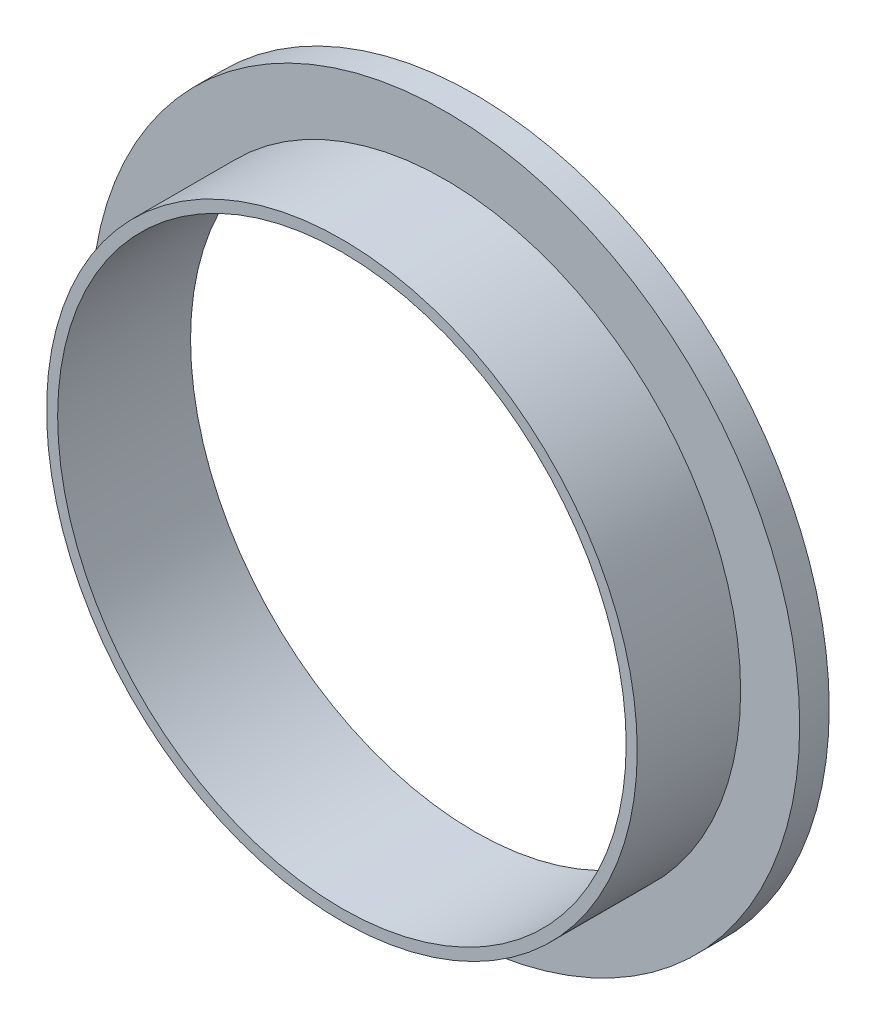
ISO-10303-21;
HEADER;
FILE_DESCRIPTION(('STEP AP214'),'2;1');
FILE_NAME('part.step','',(''),(''),'','','');
FILE_SCHEMA(('AUTOMOTIVE_DESIGN { 1 0 10303 214 1 1 1 1 }'));
ENDSEC;
DATA;
#1=APPLICATION_CONTEXT('core data for automotive mechanical design processes');
#2=APPLICATION_PROTOCOL_DEFINITION('international standard','automotive_design',2000,#1);
#3=PRODUCT_CONTEXT('',#1,'mechanical');
#4=PRODUCT('Part','Part','',(#3));
#5=PRODUCT_RELATED_PRODUCT_CATEGORY('part','',(#4));
#6=PRODUCT_DEFINITION_FORMATION('','',#4);
#7=PRODUCT_DEFINITION_CONTEXT('part definition',#1,'design');
#8=PRODUCT_DEFINITION('design','',#6,#7);
#9=PRODUCT_DEFINITION_SHAPE('','',#8);
#10=(LENGTH_UNIT() NAMED_UNIT(*) SI_UNIT(.MILLI.,.METRE.));
#11=(NAMED_UNIT(*) PLANE_ANGLE_UNIT() SI_UNIT($,.RADIAN.));
#12=(NAMED_UNIT(*) SI_UNIT($,.STERADIAN.) SOLID_ANGLE_UNIT());
#13=UNCERTAINTY_MEASURE_WITH_UNIT(LENGTH_MEASURE(1.E-05),#10,'distance_accuracy_value','');
#14=(GEOMETRIC_REPRESENTATION_CONTEXT(3) GLOBAL_UNCERTAINTY_ASSIGNED_CONTEXT((#13)) GLOBAL_UNIT_ASSIGNED_CONTEXT((#10,
#11,#12)) REPRESENTATION_CONTEXT('',''));
#15=CARTESIAN_POINT('',(0.,0.,0.));
#16=DIRECTION('',(0.,0.,1.));
#17=DIRECTION('',(1.,0.,0.));
#18=AXIS2_PLACEMENT_3D('',#15,#16,#17);
#19=CARTESIAN_POINT('',(0.,0.,7.));
#20=DIRECTION('',(0.,0.,-1.));
#21=DIRECTION('',(-1.,0.,0.));
#22=AXIS2_PLACEMENT_3D('',#19,#20,#21);
#23=CYLINDRICAL_SURFACE('',#22,19.25);
#24=CARTESIAN_POINT('',(0.,0.,7.));
#25=DIRECTION('',(0.,0.,1.));
#26=DIRECTION('',(1.,0.,0.));
#27=AXIS2_PLACEMENT_3D('',#24,#25,#26);
#28=CIRCLE('',#27,19.25);
#29=CARTESIAN_POINT('',(19.25,0.,7.));
#30=VERTEX_POINT('',#29);
#31=EDGE_CURVE('E47',#30,#30,#28,.T.);
#32=ORIENTED_EDGE('',*,*,#31,.T.);
#33=EDGE_LOOP('',(#32));
#34=FACE_BOUND('',#33,.T.);
#35=CARTESIAN_POINT('',(0.,0.,-2.));
#36=DIRECTION('',(0.,0.,1.));
#37=DIRECTION('',(1.,0.,0.));
#38=AXIS2_PLACEMENT_3D('',#35,#36,#37);
#39=CIRCLE('',#38,19.25);
#40=CARTESIAN_POINT('',(19.25,0.,-2.));
#41=VERTEX_POINT('',#40);
#42=EDGE_CURVE('E59',#41,#41,#39,.T.);
#43=ORIENTED_EDGE('',*,*,#42,.F.);
#44=EDGE_LOOP('',(#43));
#45=FACE_BOUND('',#44,.T.);
#46=ADVANCED_FACE('F39',(#34,#45),#23,.F.);
#47=CARTESIAN_POINT('',(0.,0.,7.));
#48=DIRECTION('',(0.,0.,-1.));
#49=DIRECTION('',(-1.,0.,0.));
#50=AXIS2_PLACEMENT_3D('',#47,#48,#49);
#51=CYLINDRICAL_SURFACE('',#50,20.);
#52=CARTESIAN_POINT('',(0.,0.,7.));
#53=DIRECTION('',(0.,0.,1.));
#54=DIRECTION('',(1.,0.,0.));
#55=AXIS2_PLACEMENT_3D('',#52,#53,#54);
#56=CIRCLE('',#55,20.);
#57=CARTESIAN_POINT('',(20.,0.,7.));
#58=VERTEX_POINT('',#57);
#59=EDGE_CURVE('E10',#58,#58,#56,.T.);
#60=ORIENTED_EDGE('',*,*,#59,.F.);
#61=EDGE_LOOP('',(#60));
#62=FACE_BOUND('',#61,.T.);
#63=CARTESIAN_POINT('',(0.,0.,0.));
#64=DIRECTION('',(0.,0.,1.));
#65=DIRECTION('',(1.,0.,0.));
#66=AXIS2_PLACEMENT_3D('',#63,#64,#65);
#67=CIRCLE('',#66,20.);
#68=CARTESIAN_POINT('',(20.,0.,0.));
#69=VERTEX_POINT('',#68);
#70=EDGE_CURVE('E42',#69,#69,#67,.T.);
#71=ORIENTED_EDGE('',*,*,#70,.T.);
#72=EDGE_LOOP('',(#71));
#73=FACE_BOUND('',#72,.T.);
#74=ADVANCED_FACE('F78',(#62,#73),#51,.T.);
#75=CARTESIAN_POINT('',(0.,0.,7.));
#76=DIRECTION('',(0.,0.,1.));
#77=DIRECTION('',(1.,0.,0.));
#78=AXIS2_PLACEMENT_3D('',#75,#76,#77);
#79=PLANE('',#78);
#80=ORIENTED_EDGE('',*,*,#31,.F.);
#81=EDGE_LOOP('',(#80));
#82=FACE_BOUND('',#81,.T.);
#83=ORIENTED_EDGE('',*,*,#59,.T.);
#84=EDGE_LOOP('',(#83));
#85=FACE_BOUND('',#84,.T.);
#86=ADVANCED_FACE('F83',(#82,#85),#79,.T.);
#87=CARTESIAN_POINT('',(0.,0.,-2.));
#88=DIRECTION('',(0.,0.,1.));
#89=DIRECTION('',(1.,0.,0.));
#90=AXIS2_PLACEMENT_3D('',#87,#88,#89);
#91=CYLINDRICAL_SURFACE('',#90,24.);
#92=CARTESIAN_POINT('',(0.,0.,-2.));
#93=DIRECTION('',(0.,0.,1.));
#94=DIRECTION('',(1.,0.,0.));
#95=AXIS2_PLACEMENT_3D('',#92,#93,#94);
#96=CIRCLE('',#95,24.);
#97=CARTESIAN_POINT('',(24.,0.,-2.));
#98=VERTEX_POINT('',#97);
#99=EDGE_CURVE('E58',#98,#98,#96,.T.);
#100=ORIENTED_EDGE('',*,*,#99,.T.);
#101=EDGE_LOOP('',(#100));
#102=FACE_BOUND('',#101,.T.);
#103=CARTESIAN_POINT('',(0.,0.,0.));
#104=DIRECTION('',(0.,0.,1.));
#105=DIRECTION('',(1.,0.,0.));
#106=AXIS2_PLACEMENT_3D('',#103,#104,#105);
#107=CIRCLE('',#106,24.);
#108=CARTESIAN_POINT('',(24.,0.,0.));
#109=VERTEX_POINT('',#108);
#110=EDGE_CURVE('E54',#109,#109,#107,.T.);
#111=ORIENTED_EDGE('',*,*,#110,.F.);
#112=EDGE_LOOP('',(#111));
#113=FACE_BOUND('',#112,.T.);
#114=ADVANCED_FACE('F67',(#102,#113),#91,.T.);
#115=CARTESIAN_POINT('',(0.,0.,-2.));
#116=DIRECTION('',(0.,0.,1.));
#117=DIRECTION('',(1.,0.,0.));
#118=AXIS2_PLACEMENT_3D('',#115,#116,#117);
#119=PLANE('',#118);
#120=ORIENTED_EDGE('',*,*,#99,.F.);
#121=EDGE_LOOP('',(#120));
#122=FACE_BOUND('',#121,.T.);
#123=ORIENTED_EDGE('',*,*,#42,.T.);
#124=EDGE_LOOP('',(#123));
#125=FACE_BOUND('',#124,.T.);
#126=ADVANCED_FACE('F70',(#122,#125),#119,.F.);
#127=CARTESIAN_POINT('',(0.,0.,0.));
#128=DIRECTION('',(0.,0.,1.));
#129=DIRECTION('',(1.,0.,0.));
#130=AXIS2_PLACEMENT_3D('',#127,#128,#129);
#131=PLANE('',#130);
#132=ORIENTED_EDGE('',*,*,#70,.F.);
#133=EDGE_LOOP('',(#132));
#134=FACE_BOUND('',#133,.T.);
#135=ORIENTED_EDGE('',*,*,#110,.T.);
#136=EDGE_LOOP('',(#135));
#137=FACE_BOUND('',#136,.T.);
#138=ADVANCED_FACE('F73',(#134,#137),#131,.T.);
#139=CLOSED_SHELL('',(#46,#74,#86,#114,#126,#138));
#140=MANIFOLD_SOLID_BREP('B2',#139);
#141=ADVANCED_BREP_SHAPE_REPRESENTATION('',(#18,#140),#14);
#142=SHAPE_DEFINITION_REPRESENTATION(#9,#141);
ENDSEC;
END-ISO-10303-21;
